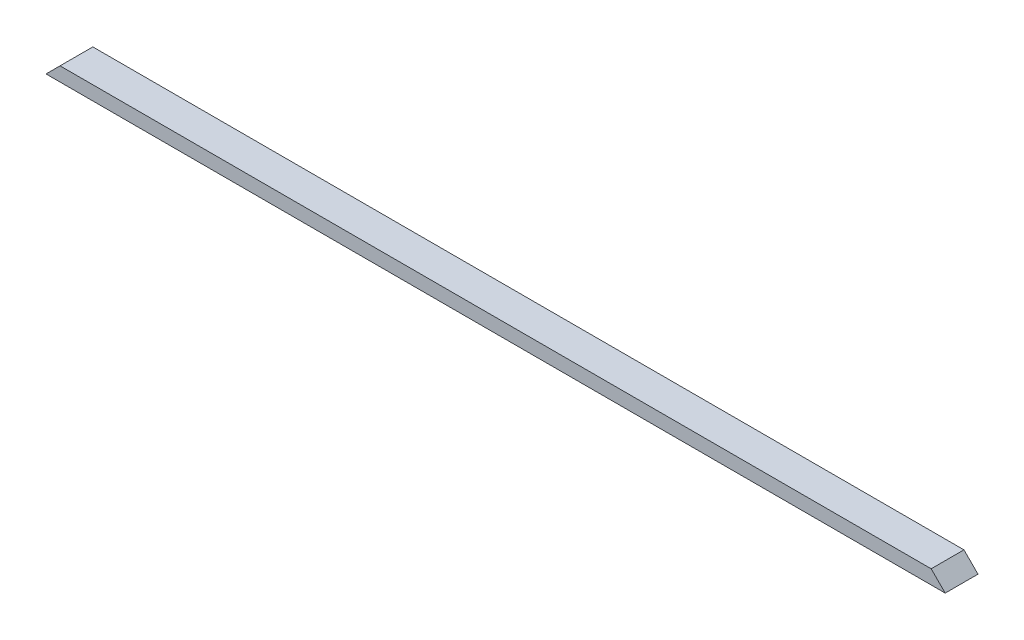
ISO-10303-21;
HEADER;
FILE_DESCRIPTION(('STEP AP214'),'2;1');
FILE_NAME('part.step','',(''),(''),'','','');
FILE_SCHEMA(('AUTOMOTIVE_DESIGN { 1 0 10303 214 1 1 1 1 }'));
ENDSEC;
DATA;
#1=APPLICATION_CONTEXT('core data for automotive mechanical design processes');
#2=APPLICATION_PROTOCOL_DEFINITION('international standard','automotive_design',2000,#1);
#3=PRODUCT_CONTEXT('',#1,'mechanical');
#4=PRODUCT('Part','Part','',(#3));
#5=PRODUCT_RELATED_PRODUCT_CATEGORY('part','',(#4));
#6=PRODUCT_DEFINITION_FORMATION('','',#4);
#7=PRODUCT_DEFINITION_CONTEXT('part definition',#1,'design');
#8=PRODUCT_DEFINITION('design','',#6,#7);
#9=PRODUCT_DEFINITION_SHAPE('','',#8);
#10=(LENGTH_UNIT() NAMED_UNIT(*) SI_UNIT(.MILLI.,.METRE.));
#11=(NAMED_UNIT(*) PLANE_ANGLE_UNIT() SI_UNIT($,.RADIAN.));
#12=(NAMED_UNIT(*) SI_UNIT($,.STERADIAN.) SOLID_ANGLE_UNIT());
#13=UNCERTAINTY_MEASURE_WITH_UNIT(LENGTH_MEASURE(1.E-05),#10,'distance_accuracy_value','');
#14=(GEOMETRIC_REPRESENTATION_CONTEXT(3) GLOBAL_UNCERTAINTY_ASSIGNED_CONTEXT((#13)) GLOBAL_UNIT_ASSIGNED_CONTEXT((#10,
#11,#12)) REPRESENTATION_CONTEXT('',''));
#15=CARTESIAN_POINT('',(0.,0.,0.));
#16=DIRECTION('',(0.,0.,1.));
#17=DIRECTION('',(1.,0.,0.));
#18=AXIS2_PLACEMENT_3D('',#15,#16,#17);
#19=CARTESIAN_POINT('',(0.,38.1,0.));
#20=DIRECTION('',(0.,0.,-1.));
#21=DIRECTION('',(-1.,0.,0.));
#22=AXIS2_PLACEMENT_3D('',#19,#20,#21);
#23=PLANE('',#22);
#24=DIRECTION('',(1.,0.,0.));
#25=VECTOR('',#24,1.);
#26=CARTESIAN_POINT('',(0.,38.1,0.));
#27=LINE('',#26,#25);
#28=CARTESIAN_POINT('',(38.1,38.1,0.));
#29=VERTEX_POINT('',#28);
#30=CARTESIAN_POINT('',(2400.3,38.1,0.));
#31=VERTEX_POINT('',#30);
#32=EDGE_CURVE('E52',#29,#31,#27,.T.);
#33=ORIENTED_EDGE('',*,*,#32,.F.);
#34=DIRECTION('',(0.707106781186547,0.707106781186547,0.));
#35=VECTOR('',#34,1.);
#36=CARTESIAN_POINT('',(0.,0.,0.));
#37=LINE('',#36,#35);
#38=CARTESIAN_POINT('',(0.,0.,0.));
#39=VERTEX_POINT('',#38);
#40=EDGE_CURVE('E87',#39,#29,#37,.T.);
#41=ORIENTED_EDGE('',*,*,#40,.F.);
#42=DIRECTION('',(1.,0.,0.));
#43=VECTOR('',#42,1.);
#44=CARTESIAN_POINT('',(0.,0.,0.));
#45=LINE('',#44,#43);
#46=CARTESIAN_POINT('',(2438.4,0.,0.));
#47=VERTEX_POINT('',#46);
#48=EDGE_CURVE('E93',#39,#47,#45,.T.);
#49=ORIENTED_EDGE('',*,*,#48,.T.);
#50=DIRECTION('',(0.707106781186548,-0.707106781186547,0.));
#51=VECTOR('',#50,1.);
#52=CARTESIAN_POINT('',(2400.3,38.1,0.));
#53=LINE('',#52,#51);
#54=EDGE_CURVE('E68',#31,#47,#53,.T.);
#55=ORIENTED_EDGE('',*,*,#54,.F.);
#56=EDGE_LOOP('',(#33,#41,#49,#55));
#57=FACE_BOUND('',#56,.T.);
#58=ADVANCED_FACE('F43',(#57),#23,.F.);
#59=CARTESIAN_POINT('',(0.,38.1,-88.9));
#60=DIRECTION('',(0.,0.,1.));
#61=DIRECTION('',(1.,0.,0.));
#62=AXIS2_PLACEMENT_3D('',#59,#60,#61);
#63=PLANE('',#62);
#64=DIRECTION('',(-1.,0.,0.));
#65=VECTOR('',#64,1.);
#66=CARTESIAN_POINT('',(0.,0.,-88.9));
#67=LINE('',#66,#65);
#68=CARTESIAN_POINT('',(2438.4,0.,-88.9));
#69=VERTEX_POINT('',#68);
#70=CARTESIAN_POINT('',(0.,0.,-88.9));
#71=VERTEX_POINT('',#70);
#72=EDGE_CURVE('E46',#69,#71,#67,.T.);
#73=ORIENTED_EDGE('',*,*,#72,.T.);
#74=DIRECTION('',(0.707106781186547,0.707106781186547,0.));
#75=VECTOR('',#74,1.);
#76=CARTESIAN_POINT('',(0.,0.,-88.9));
#77=LINE('',#76,#75);
#78=CARTESIAN_POINT('',(38.1,38.1,-88.9));
#79=VERTEX_POINT('',#78);
#80=EDGE_CURVE('E60',#71,#79,#77,.T.);
#81=ORIENTED_EDGE('',*,*,#80,.T.);
#82=DIRECTION('',(-1.,0.,0.));
#83=VECTOR('',#82,1.);
#84=CARTESIAN_POINT('',(0.,38.1,-88.9));
#85=LINE('',#84,#83);
#86=CARTESIAN_POINT('',(2400.3,38.1,-88.9));
#87=VERTEX_POINT('',#86);
#88=EDGE_CURVE('E11',#87,#79,#85,.T.);
#89=ORIENTED_EDGE('',*,*,#88,.F.);
#90=DIRECTION('',(0.707106781186548,-0.707106781186547,0.));
#91=VECTOR('',#90,1.);
#92=CARTESIAN_POINT('',(2400.3,38.1,-88.9));
#93=LINE('',#92,#91);
#94=EDGE_CURVE('E111',#87,#69,#93,.T.);
#95=ORIENTED_EDGE('',*,*,#94,.T.);
#96=EDGE_LOOP('',(#73,#81,#89,#95));
#97=FACE_BOUND('',#96,.T.);
#98=ADVANCED_FACE('F126',(#97),#63,.F.);
#99=CARTESIAN_POINT('',(0.,38.1,0.));
#100=DIRECTION('',(0.,-1.,0.));
#101=DIRECTION('',(0.,0.,-1.));
#102=AXIS2_PLACEMENT_3D('',#99,#100,#101);
#103=PLANE('',#102);
#104=ORIENTED_EDGE('',*,*,#88,.T.);
#105=DIRECTION('',(0.,0.,1.));
#106=VECTOR('',#105,1.);
#107=CARTESIAN_POINT('',(38.1,38.1,-88.9));
#108=LINE('',#107,#106);
#109=EDGE_CURVE('E94',#79,#29,#108,.T.);
#110=ORIENTED_EDGE('',*,*,#109,.T.);
#111=ORIENTED_EDGE('',*,*,#32,.T.);
#112=DIRECTION('',(0.,0.,1.));
#113=VECTOR('',#112,1.);
#114=CARTESIAN_POINT('',(2400.3,38.1,-88.9));
#115=LINE('',#114,#113);
#116=EDGE_CURVE('E115',#87,#31,#115,.T.);
#117=ORIENTED_EDGE('',*,*,#116,.F.);
#118=EDGE_LOOP('',(#104,#110,#111,#117));
#119=FACE_BOUND('',#118,.T.);
#120=ADVANCED_FACE('F129',(#119),#103,.F.);
#121=CARTESIAN_POINT('',(0.,0.,0.));
#122=DIRECTION('',(0.,-1.,0.));
#123=DIRECTION('',(0.,0.,-1.));
#124=AXIS2_PLACEMENT_3D('',#121,#122,#123);
#125=PLANE('',#124);
#126=DIRECTION('',(0.,0.,1.));
#127=VECTOR('',#126,1.);
#128=CARTESIAN_POINT('',(0.,0.,0.));
#129=LINE('',#128,#127);
#130=EDGE_CURVE('E84',#71,#39,#129,.T.);
#131=ORIENTED_EDGE('',*,*,#130,.F.);
#132=ORIENTED_EDGE('',*,*,#72,.F.);
#133=DIRECTION('',(0.,0.,-1.));
#134=VECTOR('',#133,1.);
#135=CARTESIAN_POINT('',(2438.4,0.,0.));
#136=LINE('',#135,#134);
#137=EDGE_CURVE('E103',#47,#69,#136,.T.);
#138=ORIENTED_EDGE('',*,*,#137,.F.);
#139=ORIENTED_EDGE('',*,*,#48,.F.);
#140=EDGE_LOOP('',(#131,#132,#138,#139));
#141=FACE_BOUND('',#140,.T.);
#142=ADVANCED_FACE('F102',(#141),#125,.T.);
#143=CARTESIAN_POINT('',(2400.3,38.1,-88.9));
#144=DIRECTION('',(-0.707106781186547,-0.707106781186548,0.));
#145=DIRECTION('',(0.707106781186548,-0.707106781186547,0.));
#146=AXIS2_PLACEMENT_3D('',#143,#144,#145);
#147=PLANE('',#146);
#148=ORIENTED_EDGE('',*,*,#54,.T.);
#149=ORIENTED_EDGE('',*,*,#137,.T.);
#150=ORIENTED_EDGE('',*,*,#94,.F.);
#151=ORIENTED_EDGE('',*,*,#116,.T.);
#152=EDGE_LOOP('',(#148,#149,#150,#151));
#153=FACE_BOUND('',#152,.T.);
#154=ADVANCED_FACE('F130',(#153),#147,.F.);
#155=CARTESIAN_POINT('',(0.,0.,-88.9));
#156=DIRECTION('',(0.707106781186547,-0.707106781186547,0.));
#157=DIRECTION('',(0.707106781186548,0.707106781186548,0.));
#158=AXIS2_PLACEMENT_3D('',#155,#156,#157);
#159=PLANE('',#158);
#160=ORIENTED_EDGE('',*,*,#40,.T.);
#161=ORIENTED_EDGE('',*,*,#109,.F.);
#162=ORIENTED_EDGE('',*,*,#80,.F.);
#163=ORIENTED_EDGE('',*,*,#130,.T.);
#164=EDGE_LOOP('',(#160,#161,#162,#163));
#165=FACE_BOUND('',#164,.T.);
#166=ADVANCED_FACE('F86',(#165),#159,.F.);
#167=CLOSED_SHELL('',(#58,#98,#120,#142,#154,#166));
#168=MANIFOLD_SOLID_BREP('B2',#167);
#169=ADVANCED_BREP_SHAPE_REPRESENTATION('',(#18,#168),#14);
#170=SHAPE_DEFINITION_REPRESENTATION(#9,#169);
ENDSEC;
END-ISO-10303-21;
